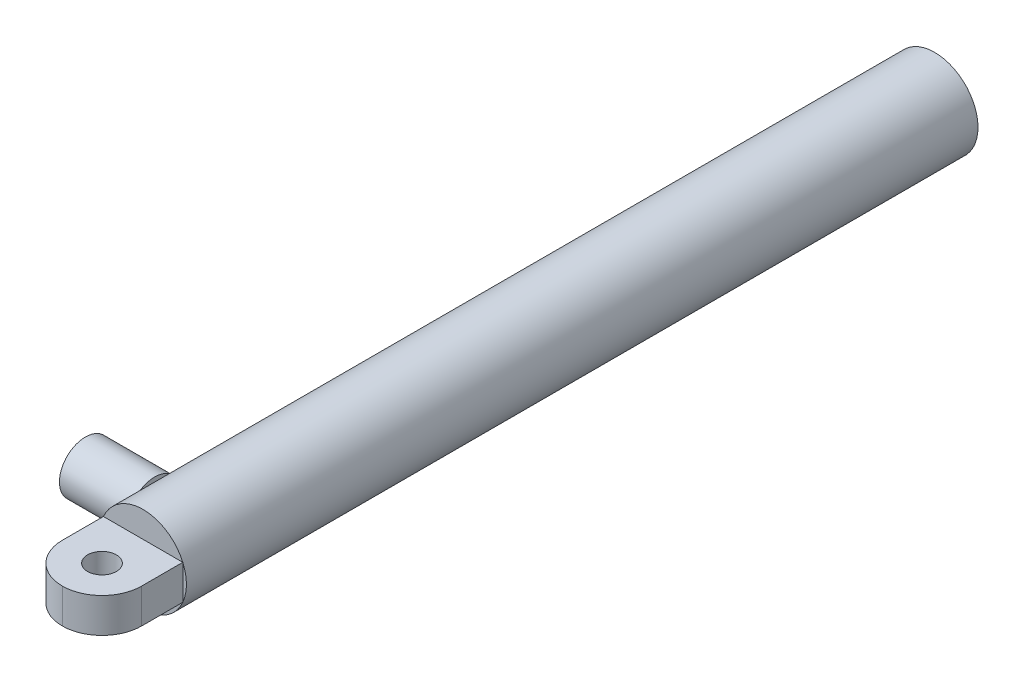
ISO-10303-21;
HEADER;
FILE_DESCRIPTION(('STEP AP214'),'2;1');
FILE_NAME('part.step','',(''),(''),'','','');
FILE_SCHEMA(('AUTOMOTIVE_DESIGN { 1 0 10303 214 1 1 1 1 }'));
ENDSEC;
DATA;
#1=APPLICATION_CONTEXT('core data for automotive mechanical design processes');
#2=APPLICATION_PROTOCOL_DEFINITION('international standard','automotive_design',2000,#1);
#3=PRODUCT_CONTEXT('',#1,'mechanical');
#4=PRODUCT('Part','Part','',(#3));
#5=PRODUCT_RELATED_PRODUCT_CATEGORY('part','',(#4));
#6=PRODUCT_DEFINITION_FORMATION('','',#4);
#7=PRODUCT_DEFINITION_CONTEXT('part definition',#1,'design');
#8=PRODUCT_DEFINITION('design','',#6,#7);
#9=PRODUCT_DEFINITION_SHAPE('','',#8);
#10=(LENGTH_UNIT() NAMED_UNIT(*) SI_UNIT(.MILLI.,.METRE.));
#11=(NAMED_UNIT(*) PLANE_ANGLE_UNIT() SI_UNIT($,.RADIAN.));
#12=(NAMED_UNIT(*) SI_UNIT($,.STERADIAN.) SOLID_ANGLE_UNIT());
#13=UNCERTAINTY_MEASURE_WITH_UNIT(LENGTH_MEASURE(1.E-05),#10,'distance_accuracy_value','');
#14=(GEOMETRIC_REPRESENTATION_CONTEXT(3) GLOBAL_UNCERTAINTY_ASSIGNED_CONTEXT((#13)) GLOBAL_UNIT_ASSIGNED_CONTEXT((#10,
#11,#12)) REPRESENTATION_CONTEXT('',''));
#15=CARTESIAN_POINT('',(0.,0.,0.));
#16=DIRECTION('',(0.,0.,1.));
#17=DIRECTION('',(1.,0.,0.));
#18=AXIS2_PLACEMENT_3D('',#15,#16,#17);
#19=CARTESIAN_POINT('',(0.,0.,664.));
#20=DIRECTION('',(0.,0.,-1.));
#21=DIRECTION('',(-1.,0.,0.));
#22=AXIS2_PLACEMENT_3D('',#19,#20,#21);
#23=CYLINDRICAL_SURFACE('',#22,37.5);
#24=CARTESIAN_POINT('',(0.,0.,686.));
#25=DIRECTION('',(0.,0.,1.));
#26=DIRECTION('',(1.,0.,0.));
#27=AXIS2_PLACEMENT_3D('',#24,#25,#26);
#28=CIRCLE('',#27,37.5);
#29=CARTESIAN_POINT('',(-34.3693177121688,-15.,686.));
#30=VERTEX_POINT('',#29);
#31=CARTESIAN_POINT('',(34.3693177121688,-15.,686.));
#32=VERTEX_POINT('',#31);
#33=EDGE_CURVE('E140',#30,#32,#28,.T.);
#34=ORIENTED_EDGE('',*,*,#33,.F.);
#35=CARTESIAN_POINT('',(-34.3693177121688,15.,686.));
#36=VERTEX_POINT('',#35);
#37=EDGE_CURVE('E139',#36,#30,#28,.T.);
#38=ORIENTED_EDGE('',*,*,#37,.F.);
#39=CARTESIAN_POINT('',(34.3693177121688,15.,686.));
#40=VERTEX_POINT('',#39);
#41=EDGE_CURVE('E266',#40,#36,#28,.T.);
#42=ORIENTED_EDGE('',*,*,#41,.F.);
#43=EDGE_CURVE('E144',#32,#40,#28,.T.);
#44=ORIENTED_EDGE('',*,*,#43,.F.);
#45=EDGE_LOOP('',(#34,#38,#42,#44));
#46=FACE_BOUND('',#45,.T.);
#47=CARTESIAN_POINT('',(0.,0.,0.));
#48=DIRECTION('',(0.,0.,1.));
#49=DIRECTION('',(1.,0.,0.));
#50=AXIS2_PLACEMENT_3D('',#47,#48,#49);
#51=CIRCLE('',#50,37.5);
#52=CARTESIAN_POINT('',(37.5,0.,0.));
#53=VERTEX_POINT('',#52);
#54=EDGE_CURVE('E150',#53,#53,#51,.T.);
#55=ORIENTED_EDGE('',*,*,#54,.T.);
#56=EDGE_LOOP('',(#55));
#57=FACE_BOUND('',#56,.T.);
#58=DIRECTION('',(0.,0.,-1.));
#59=VECTOR('',#58,1.);
#60=CARTESIAN_POINT('',(-34.3693177121688,15.,664.));
#61=LINE('',#60,#59);
#62=CARTESIAN_POINT('',(-34.3693177121688,15.,658.410509831249));
#63=VERTEX_POINT('',#62);
#64=CARTESIAN_POINT('',(-34.3693177121688,15.,624.869490168752));
#65=VERTEX_POINT('',#64);
#66=EDGE_CURVE('E11',#63,#65,#61,.T.);
#67=ORIENTED_EDGE('',*,*,#66,.F.);
#68=CARTESIAN_POINT('',(-34.3693177121688,-15.,658.410509831249));
#69=CARTESIAN_POINT('',(-34.5628287516957,-14.5567209000954,658.806987511772));
#70=CARTESIAN_POINT('',(-34.753259124379,-14.0968897878321,659.186638319474));
#71=CARTESIAN_POINT('',(-35.1240963346518,-13.1456356652409,659.910184644091));
#72=CARTESIAN_POINT('',(-35.3044968691848,-12.6541931985463,660.254057792895));
#73=CARTESIAN_POINT('',(-35.6520956851179,-11.6390565503224,660.905198090059));
#74=CARTESIAN_POINT('',(-35.8192175962027,-11.1152028643747,661.212258023929));
#75=CARTESIAN_POINT('',(-36.1352949412633,-10.0401304004241,661.784890344045));
#76=CARTESIAN_POINT('',(-36.2842536964657,-9.48891665136525,662.050470317617));
#77=CARTESIAN_POINT('',(-36.5610162796752,-8.35951880238463,662.538528200853));
#78=CARTESIAN_POINT('',(-36.6887242850449,-7.78122684512794,662.760811608805));
#79=CARTESIAN_POINT('',(-36.9188537072728,-6.60364236172032,663.158085397292));
#80=CARTESIAN_POINT('',(-37.0212737634304,-6.004348707485,663.333073232983));
#81=CARTESIAN_POINT('',(-37.1977328325532,-4.79097726725823,663.632862034061));
#82=CARTESIAN_POINT('',(-37.2718484197819,-4.17694421585507,663.757798453));
#83=CARTESIAN_POINT('',(-37.3899269709226,-2.93777964019403,663.956205468356));
#84=CARTESIAN_POINT('',(-37.4338935988896,-2.3126494740643,664.029682318764));
#85=CARTESIAN_POINT('',(-37.4877111085339,-1.11614197554258,664.119537371973));
#86=CARTESIAN_POINT('',(-37.5003823623163,-0.545240418529896,664.14063692345));
#87=CARTESIAN_POINT('',(-37.4996001361523,0.5964774996861,664.139333907304));
#88=CARTESIAN_POINT('',(-37.4861482499842,1.16729386396215,664.116933993594));
#89=CARTESIAN_POINT('',(-37.4334488595239,2.30458877960859,664.028933110377));
#90=CARTESIAN_POINT('',(-37.3941914555128,2.87106558179513,663.963315561356));
#91=CARTESIAN_POINT('',(-37.290845191301,3.99517801020673,663.789762800002));
#92=CARTESIAN_POINT('',(-37.2267565774985,4.55281372410406,663.681828007579));
#93=CARTESIAN_POINT('',(-37.078549707373,5.63158725953805,663.430563717142));
#94=CARTESIAN_POINT('',(-36.9954114593022,6.15326331708579,663.288956171824));
#95=CARTESIAN_POINT('',(-36.8095586020448,7.18189300910043,662.969801438841));
#96=CARTESIAN_POINT('',(-36.7068439901398,7.68884664152293,662.792254246186));
#97=CARTESIAN_POINT('',(-36.4838288090728,8.68568893152007,662.402833548178));
#98=CARTESIAN_POINT('',(-36.3635195473292,9.17556900495527,662.190943069999));
#99=CARTESIAN_POINT('',(-36.1076806513707,10.13570080616,661.734780668778));
#100=CARTESIAN_POINT('',(-35.9721525172412,10.6059544621988,661.490511936751));
#101=CARTESIAN_POINT('',(-35.6105717431086,11.7766767549847,660.829221146969));
#102=CARTESIAN_POINT('',(-35.3755323812738,12.4624725279757,660.390755977586));
#103=CARTESIAN_POINT('',(-35.0076626368683,13.4475411338123,659.683743444026));
#104=CARTESIAN_POINT('',(-34.8826793662466,13.7681941230643,659.440241082942));
#105=CARTESIAN_POINT('',(-34.6287075029952,14.3950282693196,658.937236098358));
#106=CARTESIAN_POINT('',(-34.4997190122279,14.7012097938685,658.677733881606));
#107=CARTESIAN_POINT('',(-34.3693177121688,15.,658.410509831249));
#108=B_SPLINE_CURVE_WITH_KNOTS('',3,(#68,#69,#70,#71,#72,#73,#74,#75,#76,#77,#78,#79,#80,#81,
#82,#83,#84,#85,#86,#87,#88,#89,#90,#91,#92,#93,#94,#95,#96,#97,#98,#99,#100,#101,#102,#103,
#104,#105,#106,#107),.UNSPECIFIED.,.F.,.F.,(4,2,2,2,2,2,2,2,2,2,2,2,2,2,2,2,2,2,2,4),(0.,
1.87594742089729,3.75306071997183,5.64028783731769,7.52716934631218,9.42234113275378,
11.3176148728852,13.2077242336482,15.0976038454355,16.8096899193566,18.5216715418299,
20.2343103119635,21.9469320881554,23.5858954528663,25.2248590451667,26.8646351149657,
28.5042496978762,31.0401351017163,32.3044261667614,33.568685104123),.UNSPECIFIED.);
#109=CARTESIAN_POINT('',(-34.3693177121688,-15.,658.410509831249));
#110=VERTEX_POINT('',#109);
#111=EDGE_CURVE('E41',#110,#63,#108,.T.);
#112=ORIENTED_EDGE('',*,*,#111,.F.);
#113=DIRECTION('',(0.,0.,-1.));
#114=VECTOR('',#113,1.);
#115=CARTESIAN_POINT('',(-34.3693177121688,-15.,664.));
#116=LINE('',#115,#114);
#117=CARTESIAN_POINT('',(-34.3693177121688,-15.,624.869490168752));
#118=VERTEX_POINT('',#117);
#119=EDGE_CURVE('E92',#118,#110,#116,.F.);
#120=ORIENTED_EDGE('',*,*,#119,.F.);
#121=CARTESIAN_POINT('',(-34.3693177121688,15.,624.869490168752));
#122=CARTESIAN_POINT('',(-34.5628287516957,14.5567209000954,624.473012488228));
#123=CARTESIAN_POINT('',(-34.753259124379,14.0968897878321,624.093361680526));
#124=CARTESIAN_POINT('',(-35.1240963346518,13.1456356652409,623.369815355909));
#125=CARTESIAN_POINT('',(-35.3044968691848,12.6541931985463,623.025942207105));
#126=CARTESIAN_POINT('',(-35.6520956851179,11.6390565503224,622.374801909941));
#127=CARTESIAN_POINT('',(-35.8192175962027,11.1152028643747,622.067741976071));
#128=CARTESIAN_POINT('',(-36.1352949412633,10.0401304004241,621.495109655955));
#129=CARTESIAN_POINT('',(-36.2842536964657,9.48891665136525,621.229529682383));
#130=CARTESIAN_POINT('',(-36.5610162796752,8.35951880238463,620.741471799147));
#131=CARTESIAN_POINT('',(-36.6887242850449,7.78122684512794,620.519188391195));
#132=CARTESIAN_POINT('',(-36.9188537072728,6.60364236172032,620.121914602708));
#133=CARTESIAN_POINT('',(-37.0212737634304,6.004348707485,619.946926767017));
#134=CARTESIAN_POINT('',(-37.1977328325532,4.79097726725823,619.647137965939));
#135=CARTESIAN_POINT('',(-37.2718484197819,4.17694421585507,619.522201547));
#136=CARTESIAN_POINT('',(-37.3899269709226,2.93777964019403,619.323794531645));
#137=CARTESIAN_POINT('',(-37.4338935988896,2.3126494740643,619.250317681236));
#138=CARTESIAN_POINT('',(-37.4877111085339,1.11614197554259,619.160462628027));
#139=CARTESIAN_POINT('',(-37.5003823623163,0.5452404185299,619.13936307655));
#140=CARTESIAN_POINT('',(-37.4996001361523,-0.596477499686092,619.140666092696));
#141=CARTESIAN_POINT('',(-37.4861482499842,-1.16729386396215,619.163066006406));
#142=CARTESIAN_POINT('',(-37.4334488595239,-2.30458877960858,619.251066889624));
#143=CARTESIAN_POINT('',(-37.3941914555128,-2.87106558179512,619.316684438644));
#144=CARTESIAN_POINT('',(-37.2908451913011,-3.99517801020673,619.490237199998));
#145=CARTESIAN_POINT('',(-37.2267565774985,-4.55281372410406,619.598171992421));
#146=CARTESIAN_POINT('',(-37.078549707373,-5.63158725953805,619.849436282858));
#147=CARTESIAN_POINT('',(-36.9954114593022,-6.15326331708579,619.991043828176));
#148=CARTESIAN_POINT('',(-36.8095586020448,-7.18189300910043,620.310198561159));
#149=CARTESIAN_POINT('',(-36.7068439901398,-7.68884664152293,620.487745753814));
#150=CARTESIAN_POINT('',(-36.4838288090728,-8.68568893152007,620.877166451822));
#151=CARTESIAN_POINT('',(-36.3635195473291,-9.17556900495527,621.089056930001));
#152=CARTESIAN_POINT('',(-36.1076806513707,-10.13570080616,621.545219331222));
#153=CARTESIAN_POINT('',(-35.9721525172412,-10.6059544621988,621.789488063249));
#154=CARTESIAN_POINT('',(-35.6105717431086,-11.7766767549847,622.450778853032));
#155=CARTESIAN_POINT('',(-35.3755323812738,-12.4624725279757,622.889244022414));
#156=CARTESIAN_POINT('',(-35.0076626368683,-13.4475411338123,623.596256555975));
#157=CARTESIAN_POINT('',(-34.8826793662466,-13.7681941230643,623.839758917058));
#158=CARTESIAN_POINT('',(-34.6287075029952,-14.3950282693196,624.342763901643));
#159=CARTESIAN_POINT('',(-34.4997190122279,-14.7012097938685,624.602266118394));
#160=CARTESIAN_POINT('',(-34.3693177121688,-15.,624.869490168752));
#161=B_SPLINE_CURVE_WITH_KNOTS('',3,(#121,#122,#123,#124,#125,#126,#127,#128,#129,#130,#131,
#132,#133,#134,#135,#136,#137,#138,#139,#140,#141,#142,#143,#144,#145,#146,#147,#148,#149,#150,
#151,#152,#153,#154,#155,#156,#157,#158,#159,#160),.UNSPECIFIED.,.F.,.F.,(4,2,2,2,2,2,2,2,2,2,2,
2,2,2,2,2,2,2,2,4),(0.,1.87594742089729,3.75306071997183,5.64028783731769,7.52716934631218,
9.42234113275378,11.3176148728852,13.2077242336482,15.0976038454355,16.8096899193566,
18.5216715418299,20.2343103119635,21.9469320881554,23.5858954528663,25.2248590451667,
26.8646351149657,28.5042496978762,31.0401351017163,32.3044261667614,33.568685104123),.UNSPECIFIED.);
#162=EDGE_CURVE('E51',#65,#118,#161,.T.);
#163=ORIENTED_EDGE('',*,*,#162,.F.);
#164=EDGE_LOOP('',(#67,#112,#120,#163));
#165=FACE_BOUND('',#164,.T.);
#166=ADVANCED_FACE('F33',(#46,#57,#165),#23,.T.);
#167=CARTESIAN_POINT('',(0.,0.,686.));
#168=DIRECTION('',(0.,0.,1.));
#169=DIRECTION('',(1.,0.,0.));
#170=AXIS2_PLACEMENT_3D('',#167,#168,#169);
#171=PLANE('',#170);
#172=DIRECTION('',(0.,-1.,0.));
#173=VECTOR('',#172,1.);
#174=CARTESIAN_POINT('',(-34.3693177121688,-15.,686.));
#175=LINE('',#174,#173);
#176=EDGE_CURVE('E123',#36,#30,#175,.T.);
#177=ORIENTED_EDGE('',*,*,#176,.F.);
#178=ORIENTED_EDGE('',*,*,#37,.T.);
#179=EDGE_LOOP('',(#177,#178));
#180=FACE_BOUND('',#179,.T.);
#181=ADVANCED_FACE('F222',(#180),#171,.T.);
#182=ORIENTED_EDGE('',*,*,#43,.T.);
#183=DIRECTION('',(0.,1.,0.));
#184=VECTOR('',#183,1.);
#185=CARTESIAN_POINT('',(34.3693177121688,-15.,686.));
#186=LINE('',#185,#184);
#187=EDGE_CURVE('E128',#32,#40,#186,.T.);
#188=ORIENTED_EDGE('',*,*,#187,.F.);
#189=EDGE_LOOP('',(#182,#188));
#190=FACE_BOUND('',#189,.T.);
#191=ADVANCED_FACE('F236',(#190),#171,.T.);
#192=DIRECTION('',(1.,0.,0.));
#193=VECTOR('',#192,1.);
#194=CARTESIAN_POINT('',(-34.3693177121688,15.,686.));
#195=LINE('',#194,#193);
#196=EDGE_CURVE('E112',#36,#40,#195,.T.);
#197=ORIENTED_EDGE('',*,*,#196,.T.);
#198=ORIENTED_EDGE('',*,*,#41,.T.);
#199=EDGE_LOOP('',(#197,#198));
#200=FACE_BOUND('',#199,.T.);
#201=ADVANCED_FACE('F223',(#200),#171,.T.);
#202=CARTESIAN_POINT('',(0.,0.,0.));
#203=DIRECTION('',(0.,0.,1.));
#204=DIRECTION('',(1.,0.,0.));
#205=AXIS2_PLACEMENT_3D('',#202,#203,#204);
#206=PLANE('',#205);
#207=ORIENTED_EDGE('',*,*,#54,.F.);
#208=EDGE_LOOP('',(#207));
#209=FACE_BOUND('',#208,.T.);
#210=CARTESIAN_POINT('',(0.,0.,0.));
#211=DIRECTION('',(0.,0.,1.));
#212=DIRECTION('',(1.,0.,0.));
#213=AXIS2_PLACEMENT_3D('',#210,#211,#212);
#214=CIRCLE('',#213,17.5);
#215=CARTESIAN_POINT('',(17.5,0.,0.));
#216=VERTEX_POINT('',#215);
#217=EDGE_CURVE('E147',#216,#216,#214,.T.);
#218=ORIENTED_EDGE('',*,*,#217,.T.);
#219=EDGE_LOOP('',(#218));
#220=FACE_BOUND('',#219,.T.);
#221=ADVANCED_FACE('F229',(#209,#220),#206,.F.);
#222=CARTESIAN_POINT('',(0.,0.,664.));
#223=DIRECTION('',(0.,0.,-1.));
#224=DIRECTION('',(-1.,0.,0.));
#225=AXIS2_PLACEMENT_3D('',#222,#223,#224);
#226=CYLINDRICAL_SURFACE('',#225,17.5);
#227=CARTESIAN_POINT('',(0.,0.,664.));
#228=DIRECTION('',(0.,0.,1.));
#229=DIRECTION('',(1.,0.,0.));
#230=AXIS2_PLACEMENT_3D('',#227,#228,#229);
#231=CIRCLE('',#230,17.5);
#232=CARTESIAN_POINT('',(17.5,0.,664.));
#233=VERTEX_POINT('',#232);
#234=EDGE_CURVE('E143',#233,#233,#231,.T.);
#235=ORIENTED_EDGE('',*,*,#234,.T.);
#236=EDGE_LOOP('',(#235));
#237=FACE_BOUND('',#236,.T.);
#238=ORIENTED_EDGE('',*,*,#217,.F.);
#239=EDGE_LOOP('',(#238));
#240=FACE_BOUND('',#239,.T.);
#241=ADVANCED_FACE('F226',(#237,#240),#226,.F.);
#242=CARTESIAN_POINT('',(0.,0.,664.));
#243=DIRECTION('',(0.,0.,1.));
#244=DIRECTION('',(1.,0.,0.));
#245=AXIS2_PLACEMENT_3D('',#242,#243,#244);
#246=PLANE('',#245);
#247=ORIENTED_EDGE('',*,*,#234,.F.);
#248=EDGE_LOOP('',(#247));
#249=FACE_BOUND('',#248,.T.);
#250=ADVANCED_FACE('F220',(#249),#246,.F.);
#251=DIRECTION('',(1.,0.,0.));
#252=VECTOR('',#251,1.);
#253=CARTESIAN_POINT('',(-34.3693177121688,-15.,686.));
#254=LINE('',#253,#252);
#255=EDGE_CURVE('E131',#30,#32,#254,.T.);
#256=ORIENTED_EDGE('',*,*,#255,.F.);
#257=ORIENTED_EDGE('',*,*,#33,.T.);
#258=EDGE_LOOP('',(#256,#257));
#259=FACE_BOUND('',#258,.T.);
#260=ADVANCED_FACE('F216',(#259),#171,.T.);
#261=CARTESIAN_POINT('',(-34.3693177121688,-15.,756.));
#262=DIRECTION('',(1.,0.,0.));
#263=DIRECTION('',(0.,0.,-1.));
#264=AXIS2_PLACEMENT_3D('',#261,#262,#263);
#265=PLANE('',#264);
#266=DIRECTION('',(0.,0.,-1.));
#267=VECTOR('',#266,1.);
#268=CARTESIAN_POINT('',(-34.3693177121688,-15.,756.));
#269=LINE('',#268,#267);
#270=CARTESIAN_POINT('',(-34.3693177121688,-15.,721.64));
#271=VERTEX_POINT('',#270);
#272=EDGE_CURVE('E137',#271,#30,#269,.T.);
#273=ORIENTED_EDGE('',*,*,#272,.F.);
#274=DIRECTION('',(0.,-1.,0.));
#275=VECTOR('',#274,1.);
#276=CARTESIAN_POINT('',(-34.3693177121688,-15.,721.64));
#277=LINE('',#276,#275);
#278=CARTESIAN_POINT('',(-34.3693177121688,15.,721.64));
#279=VERTEX_POINT('',#278);
#280=EDGE_CURVE('E101',#271,#279,#277,.F.);
#281=ORIENTED_EDGE('',*,*,#280,.T.);
#282=DIRECTION('',(0.,0.,-1.));
#283=VECTOR('',#282,1.);
#284=CARTESIAN_POINT('',(-34.3693177121688,15.,756.));
#285=LINE('',#284,#283);
#286=EDGE_CURVE('E117',#279,#36,#285,.T.);
#287=ORIENTED_EDGE('',*,*,#286,.T.);
#288=ORIENTED_EDGE('',*,*,#176,.T.);
#289=EDGE_LOOP('',(#273,#281,#287,#288));
#290=FACE_BOUND('',#289,.T.);
#291=ADVANCED_FACE('F212',(#290),#265,.F.);
#292=CARTESIAN_POINT('',(-34.3693177121688,-15.,756.));
#293=DIRECTION('',(0.,1.,0.));
#294=DIRECTION('',(0.,0.,1.));
#295=AXIS2_PLACEMENT_3D('',#292,#293,#294);
#296=PLANE('',#295);
#297=CARTESIAN_POINT('',(0.,-15.,721.64));
#298=DIRECTION('',(0.,1.,0.));
#299=DIRECTION('',(0.,0.,1.));
#300=AXIS2_PLACEMENT_3D('',#297,#298,#299);
#301=CIRCLE('',#300,12.5);
#302=CARTESIAN_POINT('',(0.,-15.,734.14));
#303=VERTEX_POINT('',#302);
#304=EDGE_CURVE('E109',#303,#303,#301,.T.);
#305=ORIENTED_EDGE('',*,*,#304,.T.);
#306=EDGE_LOOP('',(#305));
#307=FACE_BOUND('',#306,.T.);
#308=DIRECTION('',(0.,0.,-1.));
#309=VECTOR('',#308,1.);
#310=CARTESIAN_POINT('',(34.3693177121688,-15.,756.));
#311=LINE('',#310,#309);
#312=CARTESIAN_POINT('',(34.3693177121688,-15.,721.64));
#313=VERTEX_POINT('',#312);
#314=EDGE_CURVE('E127',#313,#32,#311,.T.);
#315=ORIENTED_EDGE('',*,*,#314,.F.);
#316=CARTESIAN_POINT('',(0.00931771216881871,-15.,721.64));
#317=DIRECTION('',(0.,1.,0.));
#318=DIRECTION('',(0.,0.,1.));
#319=AXIS2_PLACEMENT_3D('',#316,#317,#318);
#320=CIRCLE('',#319,34.36);
#321=CARTESIAN_POINT('',(0.00931771216881871,-15.,756.));
#322=VERTEX_POINT('',#321);
#323=EDGE_CURVE('E167',#313,#322,#320,.F.);
#324=ORIENTED_EDGE('',*,*,#323,.T.);
#325=DIRECTION('',(1.,0.,0.));
#326=VECTOR('',#325,1.);
#327=CARTESIAN_POINT('',(-34.3693177121688,-15.,756.));
#328=LINE('',#327,#326);
#329=CARTESIAN_POINT('',(-0.00931771216881871,-15.,756.));
#330=VERTEX_POINT('',#329);
#331=EDGE_CURVE('E124',#330,#322,#328,.T.);
#332=ORIENTED_EDGE('',*,*,#331,.F.);
#333=CARTESIAN_POINT('',(-0.00931771216881871,-15.,721.64));
#334=DIRECTION('',(0.,1.,0.));
#335=DIRECTION('',(0.,0.,1.));
#336=AXIS2_PLACEMENT_3D('',#333,#334,#335);
#337=CIRCLE('',#336,34.36);
#338=EDGE_CURVE('E165',#330,#271,#337,.F.);
#339=ORIENTED_EDGE('',*,*,#338,.T.);
#340=ORIENTED_EDGE('',*,*,#272,.T.);
#341=ORIENTED_EDGE('',*,*,#255,.T.);
#342=EDGE_LOOP('',(#315,#324,#332,#339,#340,#341));
#343=FACE_BOUND('',#342,.T.);
#344=ADVANCED_FACE('F208',(#307,#343),#296,.F.);
#345=CARTESIAN_POINT('',(34.3693177121688,-15.,756.));
#346=DIRECTION('',(-1.,0.,0.));
#347=DIRECTION('',(0.,0.,1.));
#348=AXIS2_PLACEMENT_3D('',#345,#346,#347);
#349=PLANE('',#348);
#350=DIRECTION('',(0.,0.,-1.));
#351=VECTOR('',#350,1.);
#352=CARTESIAN_POINT('',(34.3693177121688,15.,756.));
#353=LINE('',#352,#351);
#354=CARTESIAN_POINT('',(34.3693177121688,15.,721.64));
#355=VERTEX_POINT('',#354);
#356=EDGE_CURVE('E121',#355,#40,#353,.T.);
#357=ORIENTED_EDGE('',*,*,#356,.F.);
#358=DIRECTION('',(0.,1.,0.));
#359=VECTOR('',#358,1.);
#360=CARTESIAN_POINT('',(34.3693177121688,-15.,721.64));
#361=LINE('',#360,#359);
#362=EDGE_CURVE('E163',#355,#313,#361,.F.);
#363=ORIENTED_EDGE('',*,*,#362,.T.);
#364=ORIENTED_EDGE('',*,*,#314,.T.);
#365=ORIENTED_EDGE('',*,*,#187,.T.);
#366=EDGE_LOOP('',(#357,#363,#364,#365));
#367=FACE_BOUND('',#366,.T.);
#368=ADVANCED_FACE('F204',(#367),#349,.F.);
#369=CARTESIAN_POINT('',(0.,0.,756.));
#370=DIRECTION('',(0.,0.,-1.));
#371=DIRECTION('',(-1.,0.,0.));
#372=AXIS2_PLACEMENT_3D('',#369,#370,#371);
#373=PLANE('',#372);
#374=ORIENTED_EDGE('',*,*,#331,.T.);
#375=DIRECTION('',(0.,1.,0.));
#376=VECTOR('',#375,1.);
#377=CARTESIAN_POINT('',(0.00931771216881871,0.,756.));
#378=LINE('',#377,#376);
#379=CARTESIAN_POINT('',(0.00931771216881871,15.,756.));
#380=VERTEX_POINT('',#379);
#381=EDGE_CURVE('E156',#322,#380,#378,.T.);
#382=ORIENTED_EDGE('',*,*,#381,.T.);
#383=DIRECTION('',(1.,0.,0.));
#384=VECTOR('',#383,1.);
#385=CARTESIAN_POINT('',(-34.3693177121688,15.,756.));
#386=LINE('',#385,#384);
#387=CARTESIAN_POINT('',(-0.00931771216881871,15.,756.));
#388=VERTEX_POINT('',#387);
#389=EDGE_CURVE('E114',#388,#380,#386,.T.);
#390=ORIENTED_EDGE('',*,*,#389,.F.);
#391=DIRECTION('',(0.,-1.,0.));
#392=VECTOR('',#391,1.);
#393=CARTESIAN_POINT('',(-0.00931771216881871,0.,756.));
#394=LINE('',#393,#392);
#395=EDGE_CURVE('E153',#388,#330,#394,.T.);
#396=ORIENTED_EDGE('',*,*,#395,.T.);
#397=EDGE_LOOP('',(#374,#382,#390,#396));
#398=FACE_BOUND('',#397,.T.);
#399=ADVANCED_FACE('F200',(#398),#373,.F.);
#400=CARTESIAN_POINT('',(-34.3693177121688,15.,756.));
#401=DIRECTION('',(0.,1.,0.));
#402=DIRECTION('',(0.,0.,1.));
#403=AXIS2_PLACEMENT_3D('',#400,#401,#402);
#404=PLANE('',#403);
#405=CARTESIAN_POINT('',(0.,15.,721.64));
#406=DIRECTION('',(0.,1.,0.));
#407=DIRECTION('',(0.,0.,1.));
#408=AXIS2_PLACEMENT_3D('',#405,#406,#407);
#409=CIRCLE('',#408,12.5);
#410=CARTESIAN_POINT('',(0.,15.,734.14));
#411=VERTEX_POINT('',#410);
#412=EDGE_CURVE('E113',#411,#411,#409,.T.);
#413=ORIENTED_EDGE('',*,*,#412,.F.);
#414=EDGE_LOOP('',(#413));
#415=FACE_BOUND('',#414,.T.);
#416=ORIENTED_EDGE('',*,*,#389,.T.);
#417=CARTESIAN_POINT('',(0.00931771216881871,15.,721.64));
#418=DIRECTION('',(0.,1.,0.));
#419=DIRECTION('',(0.,0.,1.));
#420=AXIS2_PLACEMENT_3D('',#417,#418,#419);
#421=CIRCLE('',#420,34.36);
#422=EDGE_CURVE('E161',#380,#355,#421,.T.);
#423=ORIENTED_EDGE('',*,*,#422,.T.);
#424=ORIENTED_EDGE('',*,*,#356,.T.);
#425=ORIENTED_EDGE('',*,*,#196,.F.);
#426=ORIENTED_EDGE('',*,*,#286,.F.);
#427=CARTESIAN_POINT('',(-0.00931771216881871,15.,721.64));
#428=DIRECTION('',(0.,1.,0.));
#429=DIRECTION('',(0.,0.,1.));
#430=AXIS2_PLACEMENT_3D('',#427,#428,#429);
#431=CIRCLE('',#430,34.36);
#432=EDGE_CURVE('E159',#279,#388,#431,.T.);
#433=ORIENTED_EDGE('',*,*,#432,.T.);
#434=EDGE_LOOP('',(#416,#423,#424,#425,#426,#433));
#435=FACE_BOUND('',#434,.T.);
#436=ADVANCED_FACE('F196',(#415,#435),#404,.T.);
#437=CARTESIAN_POINT('',(0.00931771216881871,0.,721.64));
#438=DIRECTION('',(0.,1.,0.));
#439=DIRECTION('',(0.,0.,1.));
#440=AXIS2_PLACEMENT_3D('',#437,#438,#439);
#441=CYLINDRICAL_SURFACE('',#440,34.36);
#442=ORIENTED_EDGE('',*,*,#323,.F.);
#443=ORIENTED_EDGE('',*,*,#362,.F.);
#444=ORIENTED_EDGE('',*,*,#422,.F.);
#445=ORIENTED_EDGE('',*,*,#381,.F.);
#446=EDGE_LOOP('',(#442,#443,#444,#445));
#447=FACE_BOUND('',#446,.T.);
#448=ADVANCED_FACE('F199',(#447),#441,.T.);
#449=CARTESIAN_POINT('',(-0.00931771216881871,0.,721.64));
#450=DIRECTION('',(0.,-1.,0.));
#451=DIRECTION('',(0.,0.,-1.));
#452=AXIS2_PLACEMENT_3D('',#449,#450,#451);
#453=CYLINDRICAL_SURFACE('',#452,34.36);
#454=ORIENTED_EDGE('',*,*,#432,.F.);
#455=ORIENTED_EDGE('',*,*,#280,.F.);
#456=ORIENTED_EDGE('',*,*,#338,.F.);
#457=ORIENTED_EDGE('',*,*,#395,.F.);
#458=EDGE_LOOP('',(#454,#455,#456,#457));
#459=FACE_BOUND('',#458,.T.);
#460=ADVANCED_FACE('F35',(#459),#453,.T.);
#461=CARTESIAN_POINT('',(0.,-85.,721.64));
#462=DIRECTION('',(0.,1.,0.));
#463=DIRECTION('',(0.,0.,1.));
#464=AXIS2_PLACEMENT_3D('',#461,#462,#463);
#465=CYLINDRICAL_SURFACE('',#464,12.5);
#466=ORIENTED_EDGE('',*,*,#412,.T.);
#467=EDGE_LOOP('',(#466));
#468=FACE_BOUND('',#467,.T.);
#469=ORIENTED_EDGE('',*,*,#304,.F.);
#470=EDGE_LOOP('',(#469));
#471=FACE_BOUND('',#470,.T.);
#472=ADVANCED_FACE('F189',(#468,#471),#465,.F.);
#473=CARTESIAN_POINT('',(-94.3693177121688,0.,641.64));
#474=DIRECTION('',(1.,0.,0.));
#475=DIRECTION('',(0.,0.,-1.));
#476=AXIS2_PLACEMENT_3D('',#473,#474,#475);
#477=CYLINDRICAL_SURFACE('',#476,22.5);
#478=CARTESIAN_POINT('',(-94.3693177121688,0.,641.64));
#479=DIRECTION('',(-1.,0.,0.));
#480=DIRECTION('',(0.,0.,1.));
#481=AXIS2_PLACEMENT_3D('',#478,#479,#480);
#482=CIRCLE('',#481,22.5);
#483=CARTESIAN_POINT('',(-94.3693177121688,0.,664.14));
#484=VERTEX_POINT('',#483);
#485=EDGE_CURVE('E106',#484,#484,#482,.T.);
#486=ORIENTED_EDGE('',*,*,#485,.F.);
#487=EDGE_LOOP('',(#486));
#488=FACE_BOUND('',#487,.T.);
#489=CARTESIAN_POINT('',(-34.3693177121688,0.,641.64));
#490=DIRECTION('',(-1.,0.,0.));
#491=DIRECTION('',(0.,0.,1.));
#492=AXIS2_PLACEMENT_3D('',#489,#490,#491);
#493=CIRCLE('',#492,22.5);
#494=EDGE_CURVE('E100',#118,#110,#493,.T.);
#495=ORIENTED_EDGE('',*,*,#494,.T.);
#496=ORIENTED_EDGE('',*,*,#111,.T.);
#497=EDGE_CURVE('E104',#63,#65,#493,.T.);
#498=ORIENTED_EDGE('',*,*,#497,.T.);
#499=ORIENTED_EDGE('',*,*,#162,.T.);
#500=EDGE_LOOP('',(#495,#496,#498,#499));
#501=FACE_BOUND('',#500,.T.);
#502=ADVANCED_FACE('F103',(#488,#501),#477,.T.);
#503=CARTESIAN_POINT('',(-34.3693177121688,0.,641.64));
#504=DIRECTION('',(-1.,0.,0.));
#505=DIRECTION('',(0.,0.,1.));
#506=AXIS2_PLACEMENT_3D('',#503,#504,#505);
#507=PLANE('',#506);
#508=ORIENTED_EDGE('',*,*,#497,.F.);
#509=ORIENTED_EDGE('',*,*,#66,.T.);
#510=EDGE_LOOP('',(#508,#509));
#511=FACE_BOUND('',#510,.T.);
#512=ADVANCED_FACE('F188',(#511),#507,.F.);
#513=ORIENTED_EDGE('',*,*,#494,.F.);
#514=ORIENTED_EDGE('',*,*,#119,.T.);
#515=EDGE_LOOP('',(#513,#514));
#516=FACE_BOUND('',#515,.T.);
#517=ADVANCED_FACE('F99',(#516),#507,.F.);
#518=CARTESIAN_POINT('',(-94.3693177121688,0.,641.64));
#519=DIRECTION('',(-1.,0.,0.));
#520=DIRECTION('',(0.,0.,1.));
#521=AXIS2_PLACEMENT_3D('',#518,#519,#520);
#522=PLANE('',#521);
#523=ORIENTED_EDGE('',*,*,#485,.T.);
#524=EDGE_LOOP('',(#523));
#525=FACE_BOUND('',#524,.T.);
#526=ADVANCED_FACE('F309',(#525),#522,.T.);
#527=CLOSED_SHELL('',(#166,#181,#191,#201,#221,#241,#250,#260,#291,#344,#368,#399,#436,#448,
#460,#472,#502,#512,#517,#526));
#528=MANIFOLD_SOLID_BREP('B2',#527);
#529=ADVANCED_BREP_SHAPE_REPRESENTATION('',(#18,#528),#14);
#530=SHAPE_DEFINITION_REPRESENTATION(#9,#529);
ENDSEC;
END-ISO-10303-21;
